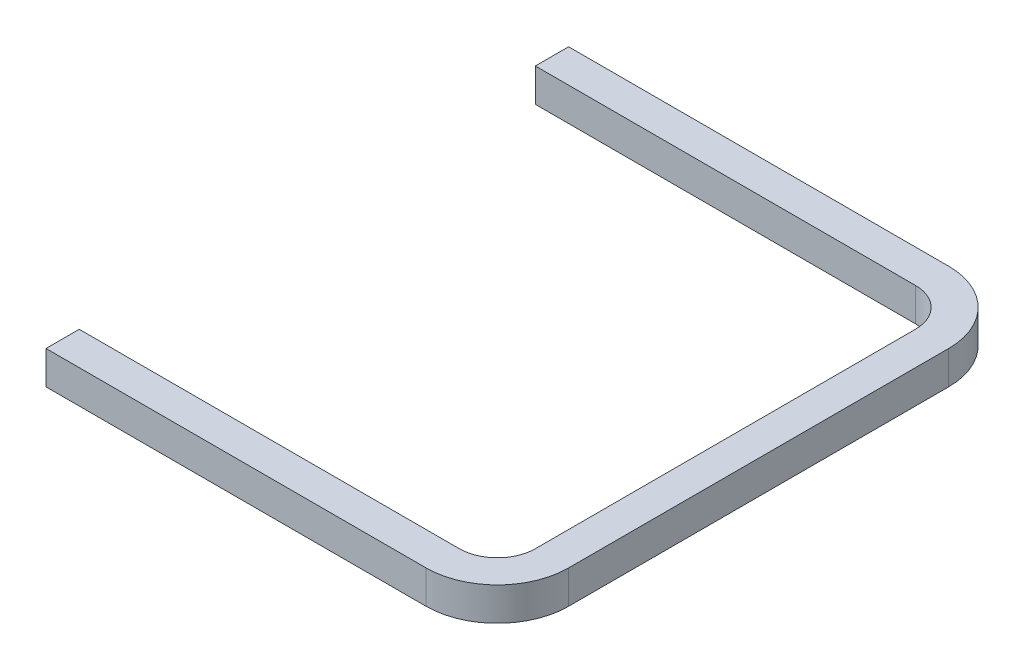
ISO-10303-21;
HEADER;
FILE_DESCRIPTION(('STEP AP214'),'2;1');
FILE_NAME('part.step','',(''),(''),'','','');
FILE_SCHEMA(('AUTOMOTIVE_DESIGN { 1 0 10303 214 1 1 1 1 }'));
ENDSEC;
DATA;
#1=APPLICATION_CONTEXT('core data for automotive mechanical design processes');
#2=APPLICATION_PROTOCOL_DEFINITION('international standard','automotive_design',2000,#1);
#3=PRODUCT_CONTEXT('',#1,'mechanical');
#4=PRODUCT('Part','Part','',(#3));
#5=PRODUCT_RELATED_PRODUCT_CATEGORY('part','',(#4));
#6=PRODUCT_DEFINITION_FORMATION('','',#4);
#7=PRODUCT_DEFINITION_CONTEXT('part definition',#1,'design');
#8=PRODUCT_DEFINITION('design','',#6,#7);
#9=PRODUCT_DEFINITION_SHAPE('','',#8);
#10=(LENGTH_UNIT() NAMED_UNIT(*) SI_UNIT(.MILLI.,.METRE.));
#11=(NAMED_UNIT(*) PLANE_ANGLE_UNIT() SI_UNIT($,.RADIAN.));
#12=(NAMED_UNIT(*) SI_UNIT($,.STERADIAN.) SOLID_ANGLE_UNIT());
#13=UNCERTAINTY_MEASURE_WITH_UNIT(LENGTH_MEASURE(1.E-05),#10,'distance_accuracy_value','');
#14=(GEOMETRIC_REPRESENTATION_CONTEXT(3) GLOBAL_UNCERTAINTY_ASSIGNED_CONTEXT((#13)) GLOBAL_UNIT_ASSIGNED_CONTEXT((#10,
#11,#12)) REPRESENTATION_CONTEXT('',''));
#15=CARTESIAN_POINT('',(0.,0.,0.));
#16=DIRECTION('',(0.,0.,1.));
#17=DIRECTION('',(1.,0.,0.));
#18=AXIS2_PLACEMENT_3D('',#15,#16,#17);
#19=CARTESIAN_POINT('',(127.,22.225,152.4));
#20=DIRECTION('',(0.,0.,1.));
#21=DIRECTION('',(1.,0.,0.));
#22=AXIS2_PLACEMENT_3D('',#19,#20,#21);
#23=PLANE('',#22);
#24=DIRECTION('',(-1.,0.,0.));
#25=VECTOR('',#24,1.);
#26=CARTESIAN_POINT('',(127.,0.,152.4));
#27=LINE('',#26,#25);
#28=CARTESIAN_POINT('',(127.,0.,152.4));
#29=VERTEX_POINT('',#28);
#30=CARTESIAN_POINT('',(-127.,0.,152.4));
#31=VERTEX_POINT('',#30);
#32=EDGE_CURVE('E168',#29,#31,#27,.T.);
#33=ORIENTED_EDGE('',*,*,#32,.T.);
#34=DIRECTION('',(0.,-1.,0.));
#35=VECTOR('',#34,1.);
#36=CARTESIAN_POINT('',(-127.,22.225,152.4));
#37=LINE('',#36,#35);
#38=CARTESIAN_POINT('',(-127.,22.225,152.4));
#39=VERTEX_POINT('',#38);
#40=EDGE_CURVE('E11',#39,#31,#37,.T.);
#41=ORIENTED_EDGE('',*,*,#40,.F.);
#42=DIRECTION('',(-1.,0.,0.));
#43=VECTOR('',#42,1.);
#44=CARTESIAN_POINT('',(127.,22.225,152.4));
#45=LINE('',#44,#43);
#46=CARTESIAN_POINT('',(127.,22.225,152.4));
#47=VERTEX_POINT('',#46);
#48=EDGE_CURVE('E112',#47,#39,#45,.T.);
#49=ORIENTED_EDGE('',*,*,#48,.F.);
#50=DIRECTION('',(0.,-1.,0.));
#51=VECTOR('',#50,1.);
#52=CARTESIAN_POINT('',(127.,22.225,152.4));
#53=LINE('',#52,#51);
#54=EDGE_CURVE('E164',#47,#29,#53,.T.);
#55=ORIENTED_EDGE('',*,*,#54,.T.);
#56=EDGE_LOOP('',(#33,#41,#49,#55));
#57=FACE_BOUND('',#56,.T.);
#58=ADVANCED_FACE('F43',(#57),#23,.F.);
#59=CARTESIAN_POINT('',(-127.,22.225,174.625));
#60=DIRECTION('',(-1.,0.,0.));
#61=DIRECTION('',(0.,0.,1.));
#62=AXIS2_PLACEMENT_3D('',#59,#60,#61);
#63=PLANE('',#62);
#64=DIRECTION('',(0.,0.,-1.));
#65=VECTOR('',#64,1.);
#66=CARTESIAN_POINT('',(-127.,0.,174.625));
#67=LINE('',#66,#65);
#68=CARTESIAN_POINT('',(-127.,0.,174.625));
#69=VERTEX_POINT('',#68);
#70=EDGE_CURVE('E172',#69,#31,#67,.T.);
#71=ORIENTED_EDGE('',*,*,#70,.F.);
#72=DIRECTION('',(0.,-1.,0.));
#73=VECTOR('',#72,1.);
#74=CARTESIAN_POINT('',(-127.,22.225,174.625));
#75=LINE('',#74,#73);
#76=CARTESIAN_POINT('',(-127.,22.225,174.625));
#77=VERTEX_POINT('',#76);
#78=EDGE_CURVE('E52',#77,#69,#75,.T.);
#79=ORIENTED_EDGE('',*,*,#78,.F.);
#80=DIRECTION('',(0.,0.,-1.));
#81=VECTOR('',#80,1.);
#82=CARTESIAN_POINT('',(-127.,22.225,174.625));
#83=LINE('',#82,#81);
#84=EDGE_CURVE('E255',#77,#39,#83,.T.);
#85=ORIENTED_EDGE('',*,*,#84,.T.);
#86=ORIENTED_EDGE('',*,*,#40,.T.);
#87=EDGE_LOOP('',(#71,#79,#85,#86));
#88=FACE_BOUND('',#87,.T.);
#89=ADVANCED_FACE('F242',(#88),#63,.T.);
#90=CARTESIAN_POINT('',(127.,22.225,174.625));
#91=DIRECTION('',(0.,0.,1.));
#92=DIRECTION('',(1.,0.,0.));
#93=AXIS2_PLACEMENT_3D('',#90,#91,#92);
#94=PLANE('',#93);
#95=DIRECTION('',(1.,0.,0.));
#96=VECTOR('',#95,1.);
#97=CARTESIAN_POINT('',(127.,0.,174.625));
#98=LINE('',#97,#96);
#99=CARTESIAN_POINT('',(127.,0.,174.625));
#100=VERTEX_POINT('',#99);
#101=EDGE_CURVE('E176',#100,#69,#98,.F.);
#102=ORIENTED_EDGE('',*,*,#101,.F.);
#103=DIRECTION('',(0.,-1.,0.));
#104=VECTOR('',#103,1.);
#105=CARTESIAN_POINT('',(127.,22.225,174.625));
#106=LINE('',#105,#104);
#107=CARTESIAN_POINT('',(127.,22.225,174.625));
#108=VERTEX_POINT('',#107);
#109=EDGE_CURVE('E230',#108,#100,#106,.T.);
#110=ORIENTED_EDGE('',*,*,#109,.F.);
#111=DIRECTION('',(1.,0.,0.));
#112=VECTOR('',#111,1.);
#113=CARTESIAN_POINT('',(127.,22.225,174.625));
#114=LINE('',#113,#112);
#115=EDGE_CURVE('E239',#108,#77,#114,.F.);
#116=ORIENTED_EDGE('',*,*,#115,.T.);
#117=ORIENTED_EDGE('',*,*,#78,.T.);
#118=EDGE_LOOP('',(#102,#110,#116,#117));
#119=FACE_BOUND('',#118,.T.);
#120=ADVANCED_FACE('F237',(#119),#94,.T.);
#121=CARTESIAN_POINT('',(127.,22.225,127.));
#122=DIRECTION('',(0.,-1.,0.));
#123=DIRECTION('',(0.,0.,-1.));
#124=AXIS2_PLACEMENT_3D('',#121,#122,#123);
#125=CYLINDRICAL_SURFACE('',#124,47.625);
#126=CARTESIAN_POINT('',(127.,0.,127.));
#127=DIRECTION('',(0.,1.,0.));
#128=DIRECTION('',(1.,0.,0.));
#129=AXIS2_PLACEMENT_3D('',#126,#127,#128);
#130=CIRCLE('',#129,47.625);
#131=CARTESIAN_POINT('',(174.625,0.,127.));
#132=VERTEX_POINT('',#131);
#133=EDGE_CURVE('E180',#132,#100,#130,.F.);
#134=ORIENTED_EDGE('',*,*,#133,.F.);
#135=DIRECTION('',(0.,-1.,0.));
#136=VECTOR('',#135,1.);
#137=CARTESIAN_POINT('',(174.625,22.225,127.));
#138=LINE('',#137,#136);
#139=CARTESIAN_POINT('',(174.625,22.225,127.));
#140=VERTEX_POINT('',#139);
#141=EDGE_CURVE('E227',#140,#132,#138,.T.);
#142=ORIENTED_EDGE('',*,*,#141,.F.);
#143=CARTESIAN_POINT('',(127.,22.225,127.));
#144=DIRECTION('',(0.,1.,0.));
#145=DIRECTION('',(1.,0.,0.));
#146=AXIS2_PLACEMENT_3D('',#143,#144,#145);
#147=CIRCLE('',#146,47.625);
#148=EDGE_CURVE('E252',#140,#108,#147,.F.);
#149=ORIENTED_EDGE('',*,*,#148,.T.);
#150=ORIENTED_EDGE('',*,*,#109,.T.);
#151=EDGE_LOOP('',(#134,#142,#149,#150));
#152=FACE_BOUND('',#151,.T.);
#153=ADVANCED_FACE('F249',(#152),#125,.T.);
#154=CARTESIAN_POINT('',(174.625,22.225,127.));
#155=DIRECTION('',(1.,0.,0.));
#156=DIRECTION('',(0.,0.,-1.));
#157=AXIS2_PLACEMENT_3D('',#154,#155,#156);
#158=PLANE('',#157);
#159=DIRECTION('',(0.,0.,-1.));
#160=VECTOR('',#159,1.);
#161=CARTESIAN_POINT('',(174.625,0.,127.));
#162=LINE('',#161,#160);
#163=CARTESIAN_POINT('',(174.625,0.,-127.));
#164=VERTEX_POINT('',#163);
#165=EDGE_CURVE('E184',#164,#132,#162,.F.);
#166=ORIENTED_EDGE('',*,*,#165,.F.);
#167=DIRECTION('',(0.,-1.,0.));
#168=VECTOR('',#167,1.);
#169=CARTESIAN_POINT('',(174.625,22.225,-127.));
#170=LINE('',#169,#168);
#171=CARTESIAN_POINT('',(174.625,22.225,-127.));
#172=VERTEX_POINT('',#171);
#173=EDGE_CURVE('E224',#172,#164,#170,.T.);
#174=ORIENTED_EDGE('',*,*,#173,.F.);
#175=DIRECTION('',(0.,0.,-1.));
#176=VECTOR('',#175,1.);
#177=CARTESIAN_POINT('',(174.625,22.225,127.));
#178=LINE('',#177,#176);
#179=EDGE_CURVE('E260',#172,#140,#178,.F.);
#180=ORIENTED_EDGE('',*,*,#179,.T.);
#181=ORIENTED_EDGE('',*,*,#141,.T.);
#182=EDGE_LOOP('',(#166,#174,#180,#181));
#183=FACE_BOUND('',#182,.T.);
#184=ADVANCED_FACE('F372',(#183),#158,.T.);
#185=CARTESIAN_POINT('',(127.,22.225,-127.));
#186=DIRECTION('',(0.,-1.,0.));
#187=DIRECTION('',(0.,0.,-1.));
#188=AXIS2_PLACEMENT_3D('',#185,#186,#187);
#189=CYLINDRICAL_SURFACE('',#188,47.625);
#190=CARTESIAN_POINT('',(127.,0.,-127.));
#191=DIRECTION('',(0.,1.,0.));
#192=DIRECTION('',(1.,0.,0.));
#193=AXIS2_PLACEMENT_3D('',#190,#191,#192);
#194=CIRCLE('',#193,47.625);
#195=CARTESIAN_POINT('',(127.,0.,-174.625));
#196=VERTEX_POINT('',#195);
#197=EDGE_CURVE('E188',#196,#164,#194,.F.);
#198=ORIENTED_EDGE('',*,*,#197,.F.);
#199=DIRECTION('',(0.,-1.,0.));
#200=VECTOR('',#199,1.);
#201=CARTESIAN_POINT('',(127.,22.225,-174.625));
#202=LINE('',#201,#200);
#203=CARTESIAN_POINT('',(127.,22.225,-174.625));
#204=VERTEX_POINT('',#203);
#205=EDGE_CURVE('E221',#204,#196,#202,.T.);
#206=ORIENTED_EDGE('',*,*,#205,.F.);
#207=CARTESIAN_POINT('',(127.,22.225,-127.));
#208=DIRECTION('',(0.,1.,0.));
#209=DIRECTION('',(1.,0.,0.));
#210=AXIS2_PLACEMENT_3D('',#207,#208,#209);
#211=CIRCLE('',#210,47.625);
#212=EDGE_CURVE('E267',#204,#172,#211,.F.);
#213=ORIENTED_EDGE('',*,*,#212,.T.);
#214=ORIENTED_EDGE('',*,*,#173,.T.);
#215=EDGE_LOOP('',(#198,#206,#213,#214));
#216=FACE_BOUND('',#215,.T.);
#217=ADVANCED_FACE('F362',(#216),#189,.T.);
#218=CARTESIAN_POINT('',(127.,22.225,-174.625));
#219=DIRECTION('',(0.,0.,-1.));
#220=DIRECTION('',(-1.,0.,0.));
#221=AXIS2_PLACEMENT_3D('',#218,#219,#220);
#222=PLANE('',#221);
#223=DIRECTION('',(1.,0.,0.));
#224=VECTOR('',#223,1.);
#225=CARTESIAN_POINT('',(127.,0.,-174.625));
#226=LINE('',#225,#224);
#227=CARTESIAN_POINT('',(-127.,0.,-174.625));
#228=VERTEX_POINT('',#227);
#229=EDGE_CURVE('E192',#228,#196,#226,.T.);
#230=ORIENTED_EDGE('',*,*,#229,.F.);
#231=DIRECTION('',(0.,-1.,0.));
#232=VECTOR('',#231,1.);
#233=CARTESIAN_POINT('',(-127.,22.225,-174.625));
#234=LINE('',#233,#232);
#235=CARTESIAN_POINT('',(-127.,22.225,-174.625));
#236=VERTEX_POINT('',#235);
#237=EDGE_CURVE('E218',#236,#228,#234,.T.);
#238=ORIENTED_EDGE('',*,*,#237,.F.);
#239=DIRECTION('',(1.,0.,0.));
#240=VECTOR('',#239,1.);
#241=CARTESIAN_POINT('',(127.,22.225,-174.625));
#242=LINE('',#241,#240);
#243=EDGE_CURVE('E271',#236,#204,#242,.T.);
#244=ORIENTED_EDGE('',*,*,#243,.T.);
#245=ORIENTED_EDGE('',*,*,#205,.T.);
#246=EDGE_LOOP('',(#230,#238,#244,#245));
#247=FACE_BOUND('',#246,.T.);
#248=ADVANCED_FACE('F286',(#247),#222,.T.);
#249=CARTESIAN_POINT('',(-127.,22.225,-152.4));
#250=DIRECTION('',(-1.,0.,0.));
#251=DIRECTION('',(0.,0.,1.));
#252=AXIS2_PLACEMENT_3D('',#249,#250,#251);
#253=PLANE('',#252);
#254=DIRECTION('',(0.,0.,-1.));
#255=VECTOR('',#254,1.);
#256=CARTESIAN_POINT('',(-127.,0.,-152.4));
#257=LINE('',#256,#255);
#258=CARTESIAN_POINT('',(-127.,0.,-152.4));
#259=VERTEX_POINT('',#258);
#260=EDGE_CURVE('E196',#259,#228,#257,.T.);
#261=ORIENTED_EDGE('',*,*,#260,.F.);
#262=DIRECTION('',(0.,-1.,0.));
#263=VECTOR('',#262,1.);
#264=CARTESIAN_POINT('',(-127.,22.225,-152.4));
#265=LINE('',#264,#263);
#266=CARTESIAN_POINT('',(-127.,22.225,-152.4));
#267=VERTEX_POINT('',#266);
#268=EDGE_CURVE('E215',#267,#259,#265,.T.);
#269=ORIENTED_EDGE('',*,*,#268,.F.);
#270=DIRECTION('',(0.,0.,-1.));
#271=VECTOR('',#270,1.);
#272=CARTESIAN_POINT('',(-127.,22.225,-152.4));
#273=LINE('',#272,#271);
#274=EDGE_CURVE('E275',#267,#236,#273,.T.);
#275=ORIENTED_EDGE('',*,*,#274,.T.);
#276=ORIENTED_EDGE('',*,*,#237,.T.);
#277=EDGE_LOOP('',(#261,#269,#275,#276));
#278=FACE_BOUND('',#277,.T.);
#279=ADVANCED_FACE('F281',(#278),#253,.T.);
#280=CARTESIAN_POINT('',(127.,22.225,-152.4));
#281=DIRECTION('',(0.,0.,-1.));
#282=DIRECTION('',(-1.,0.,0.));
#283=AXIS2_PLACEMENT_3D('',#280,#281,#282);
#284=PLANE('',#283);
#285=DIRECTION('',(1.,0.,0.));
#286=VECTOR('',#285,1.);
#287=CARTESIAN_POINT('',(127.,0.,-152.4));
#288=LINE('',#287,#286);
#289=CARTESIAN_POINT('',(127.,0.,-152.4));
#290=VERTEX_POINT('',#289);
#291=EDGE_CURVE('E200',#259,#290,#288,.T.);
#292=ORIENTED_EDGE('',*,*,#291,.T.);
#293=DIRECTION('',(0.,-1.,0.));
#294=VECTOR('',#293,1.);
#295=CARTESIAN_POINT('',(127.,22.225,-152.4));
#296=LINE('',#295,#294);
#297=CARTESIAN_POINT('',(127.,22.225,-152.4));
#298=VERTEX_POINT('',#297);
#299=EDGE_CURVE('E157',#298,#290,#296,.T.);
#300=ORIENTED_EDGE('',*,*,#299,.F.);
#301=DIRECTION('',(1.,0.,0.));
#302=VECTOR('',#301,1.);
#303=CARTESIAN_POINT('',(127.,22.225,-152.4));
#304=LINE('',#303,#302);
#305=EDGE_CURVE('E146',#267,#298,#304,.T.);
#306=ORIENTED_EDGE('',*,*,#305,.F.);
#307=ORIENTED_EDGE('',*,*,#268,.T.);
#308=EDGE_LOOP('',(#292,#300,#306,#307));
#309=FACE_BOUND('',#308,.T.);
#310=ADVANCED_FACE('F290',(#309),#284,.F.);
#311=CARTESIAN_POINT('',(127.,22.225,-127.));
#312=DIRECTION('',(0.,-1.,0.));
#313=DIRECTION('',(0.,0.,-1.));
#314=AXIS2_PLACEMENT_3D('',#311,#312,#313);
#315=CYLINDRICAL_SURFACE('',#314,25.4);
#316=CARTESIAN_POINT('',(127.,0.,-127.));
#317=DIRECTION('',(0.,-1.,0.));
#318=DIRECTION('',(0.,0.,1.));
#319=AXIS2_PLACEMENT_3D('',#316,#317,#318);
#320=CIRCLE('',#319,25.4);
#321=CARTESIAN_POINT('',(152.4,0.,-127.));
#322=VERTEX_POINT('',#321);
#323=EDGE_CURVE('E155',#290,#322,#320,.T.);
#324=ORIENTED_EDGE('',*,*,#323,.T.);
#325=DIRECTION('',(0.,-1.,0.));
#326=VECTOR('',#325,1.);
#327=CARTESIAN_POINT('',(152.4,22.225,-127.));
#328=LINE('',#327,#326);
#329=CARTESIAN_POINT('',(152.4,22.225,-127.));
#330=VERTEX_POINT('',#329);
#331=EDGE_CURVE('E152',#330,#322,#328,.T.);
#332=ORIENTED_EDGE('',*,*,#331,.F.);
#333=CARTESIAN_POINT('',(127.,22.225,-127.));
#334=DIRECTION('',(0.,-1.,0.));
#335=DIRECTION('',(0.,0.,1.));
#336=AXIS2_PLACEMENT_3D('',#333,#334,#335);
#337=CIRCLE('',#336,25.4);
#338=EDGE_CURVE('E139',#298,#330,#337,.T.);
#339=ORIENTED_EDGE('',*,*,#338,.F.);
#340=ORIENTED_EDGE('',*,*,#299,.T.);
#341=EDGE_LOOP('',(#324,#332,#339,#340));
#342=FACE_BOUND('',#341,.T.);
#343=ADVANCED_FACE('F153',(#342),#315,.F.);
#344=CARTESIAN_POINT('',(152.4,22.225,127.));
#345=DIRECTION('',(1.,0.,0.));
#346=DIRECTION('',(0.,0.,-1.));
#347=AXIS2_PLACEMENT_3D('',#344,#345,#346);
#348=PLANE('',#347);
#349=DIRECTION('',(0.,0.,1.));
#350=VECTOR('',#349,1.);
#351=CARTESIAN_POINT('',(152.4,0.,127.));
#352=LINE('',#351,#350);
#353=CARTESIAN_POINT('',(152.4,0.,127.));
#354=VERTEX_POINT('',#353);
#355=EDGE_CURVE('E100',#322,#354,#352,.T.);
#356=ORIENTED_EDGE('',*,*,#355,.T.);
#357=DIRECTION('',(0.,-1.,0.));
#358=VECTOR('',#357,1.);
#359=CARTESIAN_POINT('',(152.4,22.225,127.));
#360=LINE('',#359,#358);
#361=CARTESIAN_POINT('',(152.4,22.225,127.));
#362=VERTEX_POINT('',#361);
#363=EDGE_CURVE('E158',#362,#354,#360,.T.);
#364=ORIENTED_EDGE('',*,*,#363,.F.);
#365=DIRECTION('',(0.,0.,1.));
#366=VECTOR('',#365,1.);
#367=CARTESIAN_POINT('',(152.4,22.225,127.));
#368=LINE('',#367,#366);
#369=EDGE_CURVE('E143',#330,#362,#368,.T.);
#370=ORIENTED_EDGE('',*,*,#369,.F.);
#371=ORIENTED_EDGE('',*,*,#331,.T.);
#372=EDGE_LOOP('',(#356,#364,#370,#371));
#373=FACE_BOUND('',#372,.T.);
#374=ADVANCED_FACE('F160',(#373),#348,.F.);
#375=CARTESIAN_POINT('',(127.,22.225,127.));
#376=DIRECTION('',(0.,-1.,0.));
#377=DIRECTION('',(0.,0.,-1.));
#378=AXIS2_PLACEMENT_3D('',#375,#376,#377);
#379=CYLINDRICAL_SURFACE('',#378,25.4);
#380=CARTESIAN_POINT('',(127.,0.,127.));
#381=DIRECTION('',(0.,-1.,0.));
#382=DIRECTION('',(0.,0.,1.));
#383=AXIS2_PLACEMENT_3D('',#380,#381,#382);
#384=CIRCLE('',#383,25.4);
#385=EDGE_CURVE('E106',#354,#29,#384,.T.);
#386=ORIENTED_EDGE('',*,*,#385,.T.);
#387=ORIENTED_EDGE('',*,*,#54,.F.);
#388=CARTESIAN_POINT('',(127.,22.225,127.));
#389=DIRECTION('',(0.,-1.,0.));
#390=DIRECTION('',(0.,0.,1.));
#391=AXIS2_PLACEMENT_3D('',#388,#389,#390);
#392=CIRCLE('',#391,25.4);
#393=EDGE_CURVE('E60',#362,#47,#392,.T.);
#394=ORIENTED_EDGE('',*,*,#393,.F.);
#395=ORIENTED_EDGE('',*,*,#363,.T.);
#396=EDGE_LOOP('',(#386,#387,#394,#395));
#397=FACE_BOUND('',#396,.T.);
#398=ADVANCED_FACE('F304',(#397),#379,.F.);
#399=CARTESIAN_POINT('',(127.,22.225,127.));
#400=DIRECTION('',(0.,1.,0.));
#401=DIRECTION('',(1.,0.,0.));
#402=AXIS2_PLACEMENT_3D('',#399,#400,#401);
#403=PLANE('',#402);
#404=ORIENTED_EDGE('',*,*,#48,.T.);
#405=ORIENTED_EDGE('',*,*,#84,.F.);
#406=ORIENTED_EDGE('',*,*,#115,.F.);
#407=ORIENTED_EDGE('',*,*,#148,.F.);
#408=ORIENTED_EDGE('',*,*,#179,.F.);
#409=ORIENTED_EDGE('',*,*,#212,.F.);
#410=ORIENTED_EDGE('',*,*,#243,.F.);
#411=ORIENTED_EDGE('',*,*,#274,.F.);
#412=ORIENTED_EDGE('',*,*,#305,.T.);
#413=ORIENTED_EDGE('',*,*,#338,.T.);
#414=ORIENTED_EDGE('',*,*,#369,.T.);
#415=ORIENTED_EDGE('',*,*,#393,.T.);
#416=EDGE_LOOP('',(#404,#405,#406,#407,#408,#409,#410,#411,#412,#413,#414,#415));
#417=FACE_BOUND('',#416,.T.);
#418=ADVANCED_FACE('F141',(#417),#403,.T.);
#419=CARTESIAN_POINT('',(127.,0.,127.));
#420=DIRECTION('',(0.,1.,0.));
#421=DIRECTION('',(1.,0.,0.));
#422=AXIS2_PLACEMENT_3D('',#419,#420,#421);
#423=PLANE('',#422);
#424=ORIENTED_EDGE('',*,*,#32,.F.);
#425=ORIENTED_EDGE('',*,*,#385,.F.);
#426=ORIENTED_EDGE('',*,*,#355,.F.);
#427=ORIENTED_EDGE('',*,*,#323,.F.);
#428=ORIENTED_EDGE('',*,*,#291,.F.);
#429=ORIENTED_EDGE('',*,*,#260,.T.);
#430=ORIENTED_EDGE('',*,*,#229,.T.);
#431=ORIENTED_EDGE('',*,*,#197,.T.);
#432=ORIENTED_EDGE('',*,*,#165,.T.);
#433=ORIENTED_EDGE('',*,*,#133,.T.);
#434=ORIENTED_EDGE('',*,*,#101,.T.);
#435=ORIENTED_EDGE('',*,*,#70,.T.);
#436=EDGE_LOOP('',(#424,#425,#426,#427,#428,#429,#430,#431,#432,#433,#434,#435));
#437=FACE_BOUND('',#436,.T.);
#438=ADVANCED_FACE('F245',(#437),#423,.F.);
#439=CLOSED_SHELL('',(#58,#89,#120,#153,#184,#217,#248,#279,#310,#343,#374,#398,#418,#438));
#440=MANIFOLD_SOLID_BREP('B2',#439);
#441=ADVANCED_BREP_SHAPE_REPRESENTATION('',(#18,#440),#14);
#442=SHAPE_DEFINITION_REPRESENTATION(#9,#441);
ENDSEC;
END-ISO-10303-21;
